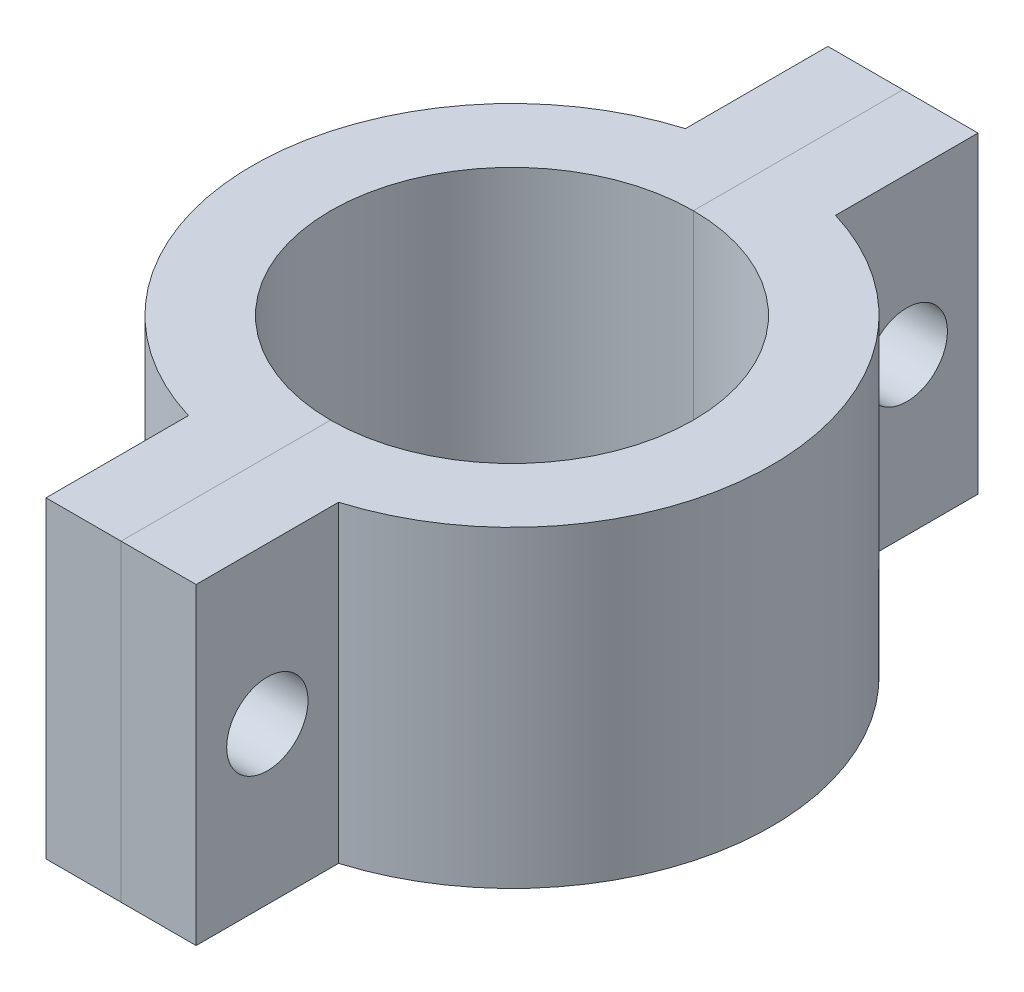
ISO-10303-21;
HEADER;
FILE_DESCRIPTION(('STEP AP214'),'2;1');
FILE_NAME('part.step','',(''),(''),'','','');
FILE_SCHEMA(('AUTOMOTIVE_DESIGN { 1 0 10303 214 1 1 1 1 }'));
ENDSEC;
DATA;
#1=APPLICATION_CONTEXT('core data for automotive mechanical design processes');
#2=APPLICATION_PROTOCOL_DEFINITION('international standard','automotive_design',2000,#1);
#3=PRODUCT_CONTEXT('',#1,'mechanical');
#4=PRODUCT('Part','Part','',(#3));
#5=PRODUCT_RELATED_PRODUCT_CATEGORY('part','',(#4));
#6=PRODUCT_DEFINITION_FORMATION('','',#4);
#7=PRODUCT_DEFINITION_CONTEXT('part definition',#1,'design');
#8=PRODUCT_DEFINITION('design','',#6,#7);
#9=PRODUCT_DEFINITION_SHAPE('','',#8);
#10=(LENGTH_UNIT() NAMED_UNIT(*) SI_UNIT(.MILLI.,.METRE.));
#11=(NAMED_UNIT(*) PLANE_ANGLE_UNIT() SI_UNIT($,.RADIAN.));
#12=(NAMED_UNIT(*) SI_UNIT($,.STERADIAN.) SOLID_ANGLE_UNIT());
#13=UNCERTAINTY_MEASURE_WITH_UNIT(LENGTH_MEASURE(1.E-05),#10,'distance_accuracy_value','');
#14=(GEOMETRIC_REPRESENTATION_CONTEXT(3) GLOBAL_UNCERTAINTY_ASSIGNED_CONTEXT((#13)) GLOBAL_UNIT_ASSIGNED_CONTEXT((#10,
#11,#12)) REPRESENTATION_CONTEXT('',''));
#15=CARTESIAN_POINT('',(0.,0.,0.));
#16=DIRECTION('',(0.,0.,1.));
#17=DIRECTION('',(1.,0.,0.));
#18=AXIS2_PLACEMENT_3D('',#15,#16,#17);
#19=CARTESIAN_POINT('',(0.,0.,0.));
#20=DIRECTION('',(-1.,0.,0.));
#21=DIRECTION('',(0.,0.,1.));
#22=AXIS2_PLACEMENT_3D('',#19,#20,#21);
#23=PLANE('',#22);
#24=CARTESIAN_POINT('',(0.,12.7,-25.9657074578545));
#25=DIRECTION('',(-1.,0.,0.));
#26=DIRECTION('',(0.,0.,1.));
#27=AXIS2_PLACEMENT_3D('',#24,#25,#26);
#28=CIRCLE('',#27,3.302);
#29=CARTESIAN_POINT('',(0.,12.7,-22.6637074578545));
#30=VERTEX_POINT('',#29);
#31=EDGE_CURVE('E191',#30,#30,#28,.F.);
#32=ORIENTED_EDGE('',*,*,#31,.T.);
#33=EDGE_LOOP('',(#32));
#34=FACE_BOUND('',#33,.T.);
#35=DIRECTION('',(0.,0.,1.));
#36=VECTOR('',#35,1.);
#37=CARTESIAN_POINT('',(0.,25.4,0.));
#38=LINE('',#37,#36);
#39=CARTESIAN_POINT('',(0.,25.4,-31.75));
#40=VERTEX_POINT('',#39);
#41=CARTESIAN_POINT('',(0.,25.4,-14.732));
#42=VERTEX_POINT('',#41);
#43=EDGE_CURVE('E151',#40,#42,#38,.T.);
#44=ORIENTED_EDGE('',*,*,#43,.F.);
#45=DIRECTION('',(0.,1.,0.));
#46=VECTOR('',#45,1.);
#47=CARTESIAN_POINT('',(0.,25.4,-31.75));
#48=LINE('',#47,#46);
#49=CARTESIAN_POINT('',(0.,0.,-31.75));
#50=VERTEX_POINT('',#49);
#51=EDGE_CURVE('E187',#50,#40,#48,.T.);
#52=ORIENTED_EDGE('',*,*,#51,.F.);
#53=DIRECTION('',(0.,0.,1.));
#54=VECTOR('',#53,1.);
#55=CARTESIAN_POINT('',(0.,0.,0.));
#56=LINE('',#55,#54);
#57=CARTESIAN_POINT('',(0.,0.,-14.732));
#58=VERTEX_POINT('',#57);
#59=EDGE_CURVE('E157',#50,#58,#56,.T.);
#60=ORIENTED_EDGE('',*,*,#59,.T.);
#61=DIRECTION('',(0.,-1.,0.));
#62=VECTOR('',#61,1.);
#63=CARTESIAN_POINT('',(0.,25.4,-14.732));
#64=LINE('',#63,#62);
#65=EDGE_CURVE('E139',#42,#58,#64,.T.);
#66=ORIENTED_EDGE('',*,*,#65,.F.);
#67=EDGE_LOOP('',(#44,#52,#60,#66));
#68=FACE_BOUND('',#67,.T.);
#69=ADVANCED_FACE('F54',(#34,#68),#23,.T.);
#70=CARTESIAN_POINT('',(0.,12.7,25.9657074578545));
#71=DIRECTION('',(-1.,0.,0.));
#72=DIRECTION('',(0.,0.,1.));
#73=AXIS2_PLACEMENT_3D('',#70,#71,#72);
#74=CIRCLE('',#73,3.302);
#75=CARTESIAN_POINT('',(0.,12.7,29.2677074578545));
#76=VERTEX_POINT('',#75);
#77=EDGE_CURVE('E189',#76,#76,#74,.F.);
#78=ORIENTED_EDGE('',*,*,#77,.T.);
#79=EDGE_LOOP('',(#78));
#80=FACE_BOUND('',#79,.T.);
#81=CARTESIAN_POINT('',(0.,25.4,14.732));
#82=VERTEX_POINT('',#81);
#83=CARTESIAN_POINT('',(0.,25.4,31.75));
#84=VERTEX_POINT('',#83);
#85=EDGE_CURVE('E150',#82,#84,#38,.T.);
#86=ORIENTED_EDGE('',*,*,#85,.F.);
#87=DIRECTION('',(0.,-1.,0.));
#88=VECTOR('',#87,1.);
#89=CARTESIAN_POINT('',(0.,25.4,14.732));
#90=LINE('',#89,#88);
#91=CARTESIAN_POINT('',(0.,0.,14.732));
#92=VERTEX_POINT('',#91);
#93=EDGE_CURVE('E136',#92,#82,#90,.F.);
#94=ORIENTED_EDGE('',*,*,#93,.F.);
#95=CARTESIAN_POINT('',(0.,0.,31.75));
#96=VERTEX_POINT('',#95);
#97=EDGE_CURVE('E149',#92,#96,#56,.T.);
#98=ORIENTED_EDGE('',*,*,#97,.T.);
#99=DIRECTION('',(0.,1.,0.));
#100=VECTOR('',#99,1.);
#101=CARTESIAN_POINT('',(0.,25.4,31.75));
#102=LINE('',#101,#100);
#103=EDGE_CURVE('E159',#96,#84,#102,.T.);
#104=ORIENTED_EDGE('',*,*,#103,.T.);
#105=EDGE_LOOP('',(#86,#94,#98,#104));
#106=FACE_BOUND('',#105,.T.);
#107=ADVANCED_FACE('F147',(#80,#106),#23,.T.);
#108=CARTESIAN_POINT('',(21.083,12.7,25.9657074578545));
#109=DIRECTION('',(-1.,0.,0.));
#110=DIRECTION('',(0.,0.,1.));
#111=AXIS2_PLACEMENT_3D('',#108,#109,#110);
#112=CYLINDRICAL_SURFACE('',#111,3.302);
#113=CARTESIAN_POINT('',(6.096,12.7,25.9657074578545));
#114=DIRECTION('',(1.,0.,0.));
#115=DIRECTION('',(0.,0.,-1.));
#116=AXIS2_PLACEMENT_3D('',#113,#114,#115);
#117=CIRCLE('',#116,3.302);
#118=CARTESIAN_POINT('',(6.096,12.7,22.6637074578545));
#119=VERTEX_POINT('',#118);
#120=EDGE_CURVE('E13',#119,#119,#117,.F.);
#121=ORIENTED_EDGE('',*,*,#120,.F.);
#122=EDGE_LOOP('',(#121));
#123=FACE_BOUND('',#122,.T.);
#124=ORIENTED_EDGE('',*,*,#77,.F.);
#125=EDGE_LOOP('',(#124));
#126=FACE_BOUND('',#125,.T.);
#127=ADVANCED_FACE('F56',(#123,#126),#112,.F.);
#128=CARTESIAN_POINT('',(21.083,12.7,-25.9657074578545));
#129=DIRECTION('',(-1.,0.,0.));
#130=DIRECTION('',(0.,0.,1.));
#131=AXIS2_PLACEMENT_3D('',#128,#129,#130);
#132=CYLINDRICAL_SURFACE('',#131,3.302);
#133=CARTESIAN_POINT('',(6.096,12.7,-25.9657074578545));
#134=DIRECTION('',(1.,0.,0.));
#135=DIRECTION('',(0.,0.,-1.));
#136=AXIS2_PLACEMENT_3D('',#133,#134,#135);
#137=CIRCLE('',#136,3.302);
#138=CARTESIAN_POINT('',(6.096,12.7,-29.2677074578545));
#139=VERTEX_POINT('',#138);
#140=EDGE_CURVE('E64',#139,#139,#137,.F.);
#141=ORIENTED_EDGE('',*,*,#140,.F.);
#142=EDGE_LOOP('',(#141));
#143=FACE_BOUND('',#142,.T.);
#144=ORIENTED_EDGE('',*,*,#31,.F.);
#145=EDGE_LOOP('',(#144));
#146=FACE_BOUND('',#145,.T.);
#147=ADVANCED_FACE('F215',(#143,#146),#132,.F.);
#148=CARTESIAN_POINT('',(0.,25.4,-31.75));
#149=DIRECTION('',(0.,0.,-1.));
#150=DIRECTION('',(-1.,0.,0.));
#151=AXIS2_PLACEMENT_3D('',#148,#149,#150);
#152=PLANE('',#151);
#153=DIRECTION('',(1.,0.,0.));
#154=VECTOR('',#153,1.);
#155=CARTESIAN_POINT('',(0.,0.,-31.75));
#156=LINE('',#155,#154);
#157=CARTESIAN_POINT('',(6.096,0.,-31.75));
#158=VERTEX_POINT('',#157);
#159=EDGE_CURVE('E171',#50,#158,#156,.T.);
#160=ORIENTED_EDGE('',*,*,#159,.F.);
#161=ORIENTED_EDGE('',*,*,#51,.T.);
#162=DIRECTION('',(1.,0.,0.));
#163=VECTOR('',#162,1.);
#164=CARTESIAN_POINT('',(0.,25.4,-31.75));
#165=LINE('',#164,#163);
#166=CARTESIAN_POINT('',(6.096,25.4,-31.75));
#167=VERTEX_POINT('',#166);
#168=EDGE_CURVE('E92',#40,#167,#165,.T.);
#169=ORIENTED_EDGE('',*,*,#168,.T.);
#170=DIRECTION('',(0.,-1.,0.));
#171=VECTOR('',#170,1.);
#172=CARTESIAN_POINT('',(6.096,25.4,-31.75));
#173=LINE('',#172,#171);
#174=EDGE_CURVE('E202',#167,#158,#173,.T.);
#175=ORIENTED_EDGE('',*,*,#174,.T.);
#176=EDGE_LOOP('',(#160,#161,#169,#175));
#177=FACE_BOUND('',#176,.T.);
#178=ADVANCED_FACE('F213',(#177),#152,.T.);
#179=CARTESIAN_POINT('',(0.,25.4,31.75));
#180=DIRECTION('',(0.,0.,-1.));
#181=DIRECTION('',(-1.,0.,0.));
#182=AXIS2_PLACEMENT_3D('',#179,#180,#181);
#183=PLANE('',#182);
#184=ORIENTED_EDGE('',*,*,#103,.F.);
#185=DIRECTION('',(1.,0.,0.));
#186=VECTOR('',#185,1.);
#187=CARTESIAN_POINT('',(0.,0.,31.75));
#188=LINE('',#187,#186);
#189=CARTESIAN_POINT('',(6.096,0.,31.75));
#190=VERTEX_POINT('',#189);
#191=EDGE_CURVE('E155',#96,#190,#188,.T.);
#192=ORIENTED_EDGE('',*,*,#191,.T.);
#193=DIRECTION('',(0.,-1.,0.));
#194=VECTOR('',#193,1.);
#195=CARTESIAN_POINT('',(6.096,25.4,31.75));
#196=LINE('',#195,#194);
#197=CARTESIAN_POINT('',(6.096,25.4,31.75));
#198=VERTEX_POINT('',#197);
#199=EDGE_CURVE('E200',#198,#190,#196,.T.);
#200=ORIENTED_EDGE('',*,*,#199,.F.);
#201=DIRECTION('',(1.,0.,0.));
#202=VECTOR('',#201,1.);
#203=CARTESIAN_POINT('',(0.,25.4,31.75));
#204=LINE('',#203,#202);
#205=EDGE_CURVE('E163',#84,#198,#204,.T.);
#206=ORIENTED_EDGE('',*,*,#205,.F.);
#207=EDGE_LOOP('',(#184,#192,#200,#206));
#208=FACE_BOUND('',#207,.T.);
#209=ADVANCED_FACE('F198',(#208),#183,.F.);
#210=CARTESIAN_POINT('',(0.,25.4,0.));
#211=DIRECTION('',(0.,-1.,0.));
#212=DIRECTION('',(0.,0.,-1.));
#213=AXIS2_PLACEMENT_3D('',#210,#211,#212);
#214=CYLINDRICAL_SURFACE('',#213,14.732);
#215=CARTESIAN_POINT('',(0.,25.4,0.));
#216=DIRECTION('',(0.,1.,0.));
#217=DIRECTION('',(0.,0.,1.));
#218=AXIS2_PLACEMENT_3D('',#215,#216,#217);
#219=CIRCLE('',#218,14.732);
#220=EDGE_CURVE('E168',#82,#42,#219,.T.);
#221=ORIENTED_EDGE('',*,*,#220,.T.);
#222=ORIENTED_EDGE('',*,*,#65,.T.);
#223=CARTESIAN_POINT('',(0.,0.,0.));
#224=DIRECTION('',(0.,1.,0.));
#225=DIRECTION('',(0.,0.,1.));
#226=AXIS2_PLACEMENT_3D('',#223,#224,#225);
#227=CIRCLE('',#226,14.732);
#228=EDGE_CURVE('E58',#92,#58,#227,.T.);
#229=ORIENTED_EDGE('',*,*,#228,.F.);
#230=ORIENTED_EDGE('',*,*,#93,.T.);
#231=EDGE_LOOP('',(#221,#222,#229,#230));
#232=FACE_BOUND('',#231,.T.);
#233=ADVANCED_FACE('F135',(#232),#214,.F.);
#234=CARTESIAN_POINT('',(0.,25.4,0.));
#235=DIRECTION('',(0.,1.,0.));
#236=DIRECTION('',(0.,0.,1.));
#237=AXIS2_PLACEMENT_3D('',#234,#235,#236);
#238=PLANE('',#237);
#239=ORIENTED_EDGE('',*,*,#168,.F.);
#240=ORIENTED_EDGE('',*,*,#43,.T.);
#241=ORIENTED_EDGE('',*,*,#220,.F.);
#242=ORIENTED_EDGE('',*,*,#85,.T.);
#243=ORIENTED_EDGE('',*,*,#205,.T.);
#244=DIRECTION('',(0.,0.,1.));
#245=VECTOR('',#244,1.);
#246=CARTESIAN_POINT('',(6.096,25.4,0.));
#247=LINE('',#246,#245);
#248=CARTESIAN_POINT('',(6.096,25.4,20.181414915709));
#249=VERTEX_POINT('',#248);
#250=EDGE_CURVE('E165',#249,#198,#247,.T.);
#251=ORIENTED_EDGE('',*,*,#250,.F.);
#252=CARTESIAN_POINT('',(0.,25.4,0.));
#253=DIRECTION('',(0.,1.,0.));
#254=DIRECTION('',(0.,0.,1.));
#255=AXIS2_PLACEMENT_3D('',#252,#253,#254);
#256=CIRCLE('',#255,21.082);
#257=CARTESIAN_POINT('',(6.096,25.4,-20.181414915709));
#258=VERTEX_POINT('',#257);
#259=EDGE_CURVE('E100',#249,#258,#256,.T.);
#260=ORIENTED_EDGE('',*,*,#259,.T.);
#261=DIRECTION('',(0.,0.,1.));
#262=VECTOR('',#261,1.);
#263=CARTESIAN_POINT('',(6.096,25.4,0.));
#264=LINE('',#263,#262);
#265=EDGE_CURVE('E167',#167,#258,#264,.T.);
#266=ORIENTED_EDGE('',*,*,#265,.F.);
#267=EDGE_LOOP('',(#239,#240,#241,#242,#243,#251,#260,#266));
#268=FACE_BOUND('',#267,.T.);
#269=ADVANCED_FACE('F201',(#268),#238,.T.);
#270=CARTESIAN_POINT('',(0.,0.,0.));
#271=DIRECTION('',(0.,1.,0.));
#272=DIRECTION('',(0.,0.,1.));
#273=AXIS2_PLACEMENT_3D('',#270,#271,#272);
#274=PLANE('',#273);
#275=ORIENTED_EDGE('',*,*,#59,.F.);
#276=ORIENTED_EDGE('',*,*,#159,.T.);
#277=DIRECTION('',(0.,0.,1.));
#278=VECTOR('',#277,1.);
#279=CARTESIAN_POINT('',(6.096,0.,0.));
#280=LINE('',#279,#278);
#281=CARTESIAN_POINT('',(6.096,0.,-20.181414915709));
#282=VERTEX_POINT('',#281);
#283=EDGE_CURVE('E172',#158,#282,#280,.T.);
#284=ORIENTED_EDGE('',*,*,#283,.T.);
#285=CARTESIAN_POINT('',(0.,0.,0.));
#286=DIRECTION('',(0.,1.,0.));
#287=DIRECTION('',(0.,0.,1.));
#288=AXIS2_PLACEMENT_3D('',#285,#286,#287);
#289=CIRCLE('',#288,21.082);
#290=CARTESIAN_POINT('',(6.096,0.,20.181414915709));
#291=VERTEX_POINT('',#290);
#292=EDGE_CURVE('E144',#291,#282,#289,.T.);
#293=ORIENTED_EDGE('',*,*,#292,.F.);
#294=DIRECTION('',(0.,0.,1.));
#295=VECTOR('',#294,1.);
#296=CARTESIAN_POINT('',(6.096,0.,0.));
#297=LINE('',#296,#295);
#298=EDGE_CURVE('E170',#291,#190,#297,.T.);
#299=ORIENTED_EDGE('',*,*,#298,.T.);
#300=ORIENTED_EDGE('',*,*,#191,.F.);
#301=ORIENTED_EDGE('',*,*,#97,.F.);
#302=ORIENTED_EDGE('',*,*,#228,.T.);
#303=EDGE_LOOP('',(#275,#276,#284,#293,#299,#300,#301,#302));
#304=FACE_BOUND('',#303,.T.);
#305=ADVANCED_FACE('F153',(#304),#274,.F.);
#306=CARTESIAN_POINT('',(0.,25.4,0.));
#307=DIRECTION('',(0.,-1.,0.));
#308=DIRECTION('',(0.,0.,-1.));
#309=AXIS2_PLACEMENT_3D('',#306,#307,#308);
#310=CYLINDRICAL_SURFACE('',#309,21.082);
#311=ORIENTED_EDGE('',*,*,#292,.T.);
#312=DIRECTION('',(0.,-1.,0.));
#313=VECTOR('',#312,1.);
#314=CARTESIAN_POINT('',(6.096,25.4,-20.181414915709));
#315=LINE('',#314,#313);
#316=EDGE_CURVE('E73',#258,#282,#315,.T.);
#317=ORIENTED_EDGE('',*,*,#316,.F.);
#318=ORIENTED_EDGE('',*,*,#259,.F.);
#319=DIRECTION('',(0.,-1.,0.));
#320=VECTOR('',#319,1.);
#321=CARTESIAN_POINT('',(6.096,25.4,20.181414915709));
#322=LINE('',#321,#320);
#323=EDGE_CURVE('E104',#249,#291,#322,.T.);
#324=ORIENTED_EDGE('',*,*,#323,.T.);
#325=EDGE_LOOP('',(#311,#317,#318,#324));
#326=FACE_BOUND('',#325,.T.);
#327=ADVANCED_FACE('F209',(#326),#310,.T.);
#328=CARTESIAN_POINT('',(6.096,25.4,0.));
#329=DIRECTION('',(1.,0.,0.));
#330=DIRECTION('',(0.,0.,-1.));
#331=AXIS2_PLACEMENT_3D('',#328,#329,#330);
#332=PLANE('',#331);
#333=ORIENTED_EDGE('',*,*,#140,.T.);
#334=EDGE_LOOP('',(#333));
#335=FACE_BOUND('',#334,.T.);
#336=ORIENTED_EDGE('',*,*,#283,.F.);
#337=ORIENTED_EDGE('',*,*,#174,.F.);
#338=ORIENTED_EDGE('',*,*,#265,.T.);
#339=ORIENTED_EDGE('',*,*,#316,.T.);
#340=EDGE_LOOP('',(#336,#337,#338,#339));
#341=FACE_BOUND('',#340,.T.);
#342=ADVANCED_FACE('F210',(#335,#341),#332,.T.);
#343=CARTESIAN_POINT('',(6.096,25.4,0.));
#344=DIRECTION('',(1.,0.,0.));
#345=DIRECTION('',(0.,0.,-1.));
#346=AXIS2_PLACEMENT_3D('',#343,#344,#345);
#347=PLANE('',#346);
#348=ORIENTED_EDGE('',*,*,#120,.T.);
#349=EDGE_LOOP('',(#348));
#350=FACE_BOUND('',#349,.T.);
#351=ORIENTED_EDGE('',*,*,#298,.F.);
#352=ORIENTED_EDGE('',*,*,#323,.F.);
#353=ORIENTED_EDGE('',*,*,#250,.T.);
#354=ORIENTED_EDGE('',*,*,#199,.T.);
#355=EDGE_LOOP('',(#351,#352,#353,#354));
#356=FACE_BOUND('',#355,.T.);
#357=ADVANCED_FACE('F208',(#350,#356),#347,.T.);
#358=CLOSED_SHELL('',(#69,#107,#127,#147,#178,#209,#233,#269,#305,#327,#342,#357));
#359=MANIFOLD_SOLID_BREP('B2',#358);
#360=CARTESIAN_POINT('',(0.,0.,0.));
#361=DIRECTION('',(-1.,0.,0.));
#362=DIRECTION('',(0.,0.,1.));
#363=AXIS2_PLACEMENT_3D('',#360,#361,#362);
#364=PLANE('',#363);
#365=DIRECTION('',(0.,0.,1.));
#366=VECTOR('',#365,1.);
#367=CARTESIAN_POINT('',(0.,25.4,0.));
#368=LINE('',#367,#366);
#369=CARTESIAN_POINT('',(0.,25.4,-31.75));
#370=VERTEX_POINT('',#369);
#371=CARTESIAN_POINT('',(0.,25.4,-14.732));
#372=VERTEX_POINT('',#371);
#373=EDGE_CURVE('E356',#370,#372,#368,.T.);
#374=ORIENTED_EDGE('',*,*,#373,.T.);
#375=DIRECTION('',(0.,-1.,0.));
#376=VECTOR('',#375,1.);
#377=CARTESIAN_POINT('',(0.,25.4,-14.732));
#378=LINE('',#377,#376);
#379=CARTESIAN_POINT('',(0.,0.,-14.732));
#380=VERTEX_POINT('',#379);
#381=EDGE_CURVE('E371',#372,#380,#378,.T.);
#382=ORIENTED_EDGE('',*,*,#381,.T.);
#383=DIRECTION('',(0.,0.,1.));
#384=VECTOR('',#383,1.);
#385=CARTESIAN_POINT('',(0.,0.,0.));
#386=LINE('',#385,#384);
#387=CARTESIAN_POINT('',(0.,0.,-31.75));
#388=VERTEX_POINT('',#387);
#389=EDGE_CURVE('E478',#388,#380,#386,.T.);
#390=ORIENTED_EDGE('',*,*,#389,.F.);
#391=DIRECTION('',(0.,1.,0.));
#392=VECTOR('',#391,1.);
#393=CARTESIAN_POINT('',(0.,25.4,-31.75));
#394=LINE('',#393,#392);
#395=EDGE_CURVE('E484',#388,#370,#394,.T.);
#396=ORIENTED_EDGE('',*,*,#395,.T.);
#397=EDGE_LOOP('',(#374,#382,#390,#396));
#398=FACE_BOUND('',#397,.T.);
#399=CARTESIAN_POINT('',(0.,12.7,-25.9657074578545));
#400=DIRECTION('',(-1.,0.,0.));
#401=DIRECTION('',(0.,0.,1.));
#402=AXIS2_PLACEMENT_3D('',#399,#400,#401);
#403=CIRCLE('',#402,3.302);
#404=CARTESIAN_POINT('',(0.,12.7,-22.6637074578545));
#405=VERTEX_POINT('',#404);
#406=EDGE_CURVE('E481',#405,#405,#403,.F.);
#407=ORIENTED_EDGE('',*,*,#406,.F.);
#408=EDGE_LOOP('',(#407));
#409=FACE_BOUND('',#408,.T.);
#410=ADVANCED_FACE('F347',(#398,#409),#364,.F.);
#411=CARTESIAN_POINT('',(0.,25.4,14.732));
#412=VERTEX_POINT('',#411);
#413=CARTESIAN_POINT('',(0.,25.4,31.75));
#414=VERTEX_POINT('',#413);
#415=EDGE_CURVE('E52',#412,#414,#368,.T.);
#416=ORIENTED_EDGE('',*,*,#415,.T.);
#417=DIRECTION('',(0.,1.,0.));
#418=VECTOR('',#417,1.);
#419=CARTESIAN_POINT('',(0.,25.4,31.75));
#420=LINE('',#419,#418);
#421=CARTESIAN_POINT('',(0.,0.,31.75));
#422=VERTEX_POINT('',#421);
#423=EDGE_CURVE('E480',#422,#414,#420,.T.);
#424=ORIENTED_EDGE('',*,*,#423,.F.);
#425=CARTESIAN_POINT('',(0.,0.,14.732));
#426=VERTEX_POINT('',#425);
#427=EDGE_CURVE('E425',#426,#422,#386,.T.);
#428=ORIENTED_EDGE('',*,*,#427,.F.);
#429=DIRECTION('',(0.,-1.,0.));
#430=VECTOR('',#429,1.);
#431=CARTESIAN_POINT('',(0.,25.4,14.732));
#432=LINE('',#431,#430);
#433=EDGE_CURVE('E363',#426,#412,#432,.F.);
#434=ORIENTED_EDGE('',*,*,#433,.T.);
#435=EDGE_LOOP('',(#416,#424,#428,#434));
#436=FACE_BOUND('',#435,.T.);
#437=CARTESIAN_POINT('',(0.,12.7,25.9657074578545));
#438=DIRECTION('',(-1.,0.,0.));
#439=DIRECTION('',(0.,0.,1.));
#440=AXIS2_PLACEMENT_3D('',#437,#438,#439);
#441=CIRCLE('',#440,3.302);
#442=CARTESIAN_POINT('',(0.,12.7,29.2677074578545));
#443=VERTEX_POINT('',#442);
#444=EDGE_CURVE('E351',#443,#443,#441,.F.);
#445=ORIENTED_EDGE('',*,*,#444,.F.);
#446=EDGE_LOOP('',(#445));
#447=FACE_BOUND('',#446,.T.);
#448=ADVANCED_FACE('F349',(#436,#447),#364,.F.);
#449=CARTESIAN_POINT('',(-1.016,12.7,-25.9657074578545));
#450=DIRECTION('',(-1.,0.,0.));
#451=DIRECTION('',(0.,0.,1.));
#452=AXIS2_PLACEMENT_3D('',#449,#450,#451);
#453=CYLINDRICAL_SURFACE('',#452,4.7625);
#454=CARTESIAN_POINT('',(-1.016,12.7,-25.9657074578545));
#455=DIRECTION('',(-1.,0.,0.));
#456=DIRECTION('',(0.,0.,1.));
#457=AXIS2_PLACEMENT_3D('',#454,#455,#456);
#458=CIRCLE('',#457,4.7625);
#459=CARTESIAN_POINT('',(-1.016,12.7,-21.2032074578545));
#460=VERTEX_POINT('',#459);
#461=EDGE_CURVE('E474',#460,#460,#458,.T.);
#462=ORIENTED_EDGE('',*,*,#461,.F.);
#463=EDGE_LOOP('',(#462));
#464=FACE_BOUND('',#463,.T.);
#465=CARTESIAN_POINT('',(-6.096,12.7,-25.9657074578545));
#466=DIRECTION('',(-1.,0.,0.));
#467=DIRECTION('',(0.,0.,1.));
#468=AXIS2_PLACEMENT_3D('',#465,#466,#467);
#469=CIRCLE('',#468,4.7625);
#470=CARTESIAN_POINT('',(-6.096,12.7,-21.2032074578545));
#471=VERTEX_POINT('',#470);
#472=EDGE_CURVE('E652',#471,#471,#469,.T.);
#473=ORIENTED_EDGE('',*,*,#472,.T.);
#474=EDGE_LOOP('',(#473));
#475=FACE_BOUND('',#474,.T.);
#476=ADVANCED_FACE('F495',(#464,#475),#453,.F.);
#477=CARTESIAN_POINT('',(-1.016,12.7,25.9657074578545));
#478=DIRECTION('',(-1.,0.,0.));
#479=DIRECTION('',(0.,0.,1.));
#480=AXIS2_PLACEMENT_3D('',#477,#478,#479);
#481=CYLINDRICAL_SURFACE('',#480,4.7625);
#482=CARTESIAN_POINT('',(-1.016,12.7,25.9657074578545));
#483=DIRECTION('',(-1.,0.,0.));
#484=DIRECTION('',(0.,0.,1.));
#485=AXIS2_PLACEMENT_3D('',#482,#483,#484);
#486=CIRCLE('',#485,4.7625);
#487=CARTESIAN_POINT('',(-1.01599999999999,12.7,30.7282074578545));
#488=VERTEX_POINT('',#487);
#489=EDGE_CURVE('E648',#488,#488,#486,.T.);
#490=ORIENTED_EDGE('',*,*,#489,.F.);
#491=EDGE_LOOP('',(#490));
#492=FACE_BOUND('',#491,.T.);
#493=CARTESIAN_POINT('',(-6.096,12.7,25.9657074578545));
#494=DIRECTION('',(-1.,0.,0.));
#495=DIRECTION('',(0.,0.,1.));
#496=AXIS2_PLACEMENT_3D('',#493,#494,#495);
#497=CIRCLE('',#496,4.7625);
#498=CARTESIAN_POINT('',(-6.09599999999999,12.7,30.7282074578545));
#499=VERTEX_POINT('',#498);
#500=EDGE_CURVE('E651',#499,#499,#497,.T.);
#501=ORIENTED_EDGE('',*,*,#500,.T.);
#502=EDGE_LOOP('',(#501));
#503=FACE_BOUND('',#502,.T.);
#504=ADVANCED_FACE('F501',(#492,#503),#481,.F.);
#505=CARTESIAN_POINT('',(-6.096,25.4,0.));
#506=DIRECTION('',(1.,0.,0.));
#507=DIRECTION('',(0.,0.,-1.));
#508=AXIS2_PLACEMENT_3D('',#505,#506,#507);
#509=PLANE('',#508);
#510=ORIENTED_EDGE('',*,*,#472,.F.);
#511=EDGE_LOOP('',(#510));
#512=FACE_BOUND('',#511,.T.);
#513=DIRECTION('',(0.,0.,1.));
#514=VECTOR('',#513,1.);
#515=CARTESIAN_POINT('',(-6.096,0.,0.));
#516=LINE('',#515,#514);
#517=CARTESIAN_POINT('',(-6.096,0.,-31.75));
#518=VERTEX_POINT('',#517);
#519=CARTESIAN_POINT('',(-6.096,0.,-20.181414915709));
#520=VERTEX_POINT('',#519);
#521=EDGE_CURVE('E457',#518,#520,#516,.T.);
#522=ORIENTED_EDGE('',*,*,#521,.T.);
#523=DIRECTION('',(0.,-1.,0.));
#524=VECTOR('',#523,1.);
#525=CARTESIAN_POINT('',(-6.096,25.4,-20.181414915709));
#526=LINE('',#525,#524);
#527=CARTESIAN_POINT('',(-6.096,25.4,-20.181414915709));
#528=VERTEX_POINT('',#527);
#529=EDGE_CURVE('E426',#528,#520,#526,.T.);
#530=ORIENTED_EDGE('',*,*,#529,.F.);
#531=DIRECTION('',(0.,0.,1.));
#532=VECTOR('',#531,1.);
#533=CARTESIAN_POINT('',(-6.096,25.4,0.));
#534=LINE('',#533,#532);
#535=CARTESIAN_POINT('',(-6.096,25.4,-31.75));
#536=VERTEX_POINT('',#535);
#537=EDGE_CURVE('E429',#536,#528,#534,.T.);
#538=ORIENTED_EDGE('',*,*,#537,.F.);
#539=DIRECTION('',(0.,-1.,0.));
#540=VECTOR('',#539,1.);
#541=CARTESIAN_POINT('',(-6.096,25.4,-31.75));
#542=LINE('',#541,#540);
#543=EDGE_CURVE('E416',#536,#518,#542,.T.);
#544=ORIENTED_EDGE('',*,*,#543,.T.);
#545=EDGE_LOOP('',(#522,#530,#538,#544));
#546=FACE_BOUND('',#545,.T.);
#547=ADVANCED_FACE('F430',(#512,#546),#509,.F.);
#548=CARTESIAN_POINT('',(0.,25.4,0.));
#549=DIRECTION('',(0.,-1.,0.));
#550=DIRECTION('',(0.,0.,-1.));
#551=AXIS2_PLACEMENT_3D('',#548,#549,#550);
#552=CYLINDRICAL_SURFACE('',#551,21.082);
#553=CARTESIAN_POINT('',(0.,0.,0.));
#554=DIRECTION('',(0.,1.,0.));
#555=DIRECTION('',(0.,0.,1.));
#556=AXIS2_PLACEMENT_3D('',#553,#554,#555);
#557=CIRCLE('',#556,21.082);
#558=CARTESIAN_POINT('',(-6.096,0.,20.181414915709));
#559=VERTEX_POINT('',#558);
#560=EDGE_CURVE('E459',#520,#559,#557,.T.);
#561=ORIENTED_EDGE('',*,*,#560,.T.);
#562=DIRECTION('',(0.,-1.,0.));
#563=VECTOR('',#562,1.);
#564=CARTESIAN_POINT('',(-6.096,25.4,20.181414915709));
#565=LINE('',#564,#563);
#566=CARTESIAN_POINT('',(-6.096,25.4,20.181414915709));
#567=VERTEX_POINT('',#566);
#568=EDGE_CURVE('E467',#567,#559,#565,.T.);
#569=ORIENTED_EDGE('',*,*,#568,.F.);
#570=CARTESIAN_POINT('',(0.,25.4,0.));
#571=DIRECTION('',(0.,1.,0.));
#572=DIRECTION('',(0.,0.,1.));
#573=AXIS2_PLACEMENT_3D('',#570,#571,#572);
#574=CIRCLE('',#573,21.082);
#575=EDGE_CURVE('E434',#528,#567,#574,.T.);
#576=ORIENTED_EDGE('',*,*,#575,.F.);
#577=ORIENTED_EDGE('',*,*,#529,.T.);
#578=EDGE_LOOP('',(#561,#569,#576,#577));
#579=FACE_BOUND('',#578,.T.);
#580=ADVANCED_FACE('F531',(#579),#552,.T.);
#581=CARTESIAN_POINT('',(-6.096,25.4,0.));
#582=DIRECTION('',(1.,0.,0.));
#583=DIRECTION('',(0.,0.,-1.));
#584=AXIS2_PLACEMENT_3D('',#581,#582,#583);
#585=PLANE('',#584);
#586=ORIENTED_EDGE('',*,*,#500,.F.);
#587=EDGE_LOOP('',(#586));
#588=FACE_BOUND('',#587,.T.);
#589=DIRECTION('',(0.,0.,1.));
#590=VECTOR('',#589,1.);
#591=CARTESIAN_POINT('',(-6.096,0.,0.));
#592=LINE('',#591,#590);
#593=CARTESIAN_POINT('',(-6.096,0.,31.75));
#594=VERTEX_POINT('',#593);
#595=EDGE_CURVE('E461',#559,#594,#592,.T.);
#596=ORIENTED_EDGE('',*,*,#595,.T.);
#597=DIRECTION('',(0.,-1.,0.));
#598=VECTOR('',#597,1.);
#599=CARTESIAN_POINT('',(-6.096,25.4,31.75));
#600=LINE('',#599,#598);
#601=CARTESIAN_POINT('',(-6.096,25.4,31.75));
#602=VERTEX_POINT('',#601);
#603=EDGE_CURVE('E451',#602,#594,#600,.T.);
#604=ORIENTED_EDGE('',*,*,#603,.F.);
#605=DIRECTION('',(0.,0.,1.));
#606=VECTOR('',#605,1.);
#607=CARTESIAN_POINT('',(-6.096,25.4,0.));
#608=LINE('',#607,#606);
#609=EDGE_CURVE('E446',#567,#602,#608,.T.);
#610=ORIENTED_EDGE('',*,*,#609,.F.);
#611=ORIENTED_EDGE('',*,*,#568,.T.);
#612=EDGE_LOOP('',(#596,#604,#610,#611));
#613=FACE_BOUND('',#612,.T.);
#614=ADVANCED_FACE('F527',(#588,#613),#585,.F.);
#615=CARTESIAN_POINT('',(0.,25.4,31.75));
#616=DIRECTION('',(0.,0.,-1.));
#617=DIRECTION('',(-1.,0.,0.));
#618=AXIS2_PLACEMENT_3D('',#615,#616,#617);
#619=PLANE('',#618);
#620=DIRECTION('',(1.,0.,0.));
#621=VECTOR('',#620,1.);
#622=CARTESIAN_POINT('',(0.,0.,31.75));
#623=LINE('',#622,#621);
#624=EDGE_CURVE('E441',#594,#422,#623,.T.);
#625=ORIENTED_EDGE('',*,*,#624,.T.);
#626=ORIENTED_EDGE('',*,*,#423,.T.);
#627=DIRECTION('',(1.,0.,0.));
#628=VECTOR('',#627,1.);
#629=CARTESIAN_POINT('',(0.,25.4,31.75));
#630=LINE('',#629,#628);
#631=EDGE_CURVE('E448',#602,#414,#630,.T.);
#632=ORIENTED_EDGE('',*,*,#631,.F.);
#633=ORIENTED_EDGE('',*,*,#603,.T.);
#634=EDGE_LOOP('',(#625,#626,#632,#633));
#635=FACE_BOUND('',#634,.T.);
#636=ADVANCED_FACE('F524',(#635),#619,.F.);
#637=CARTESIAN_POINT('',(0.,25.4,0.));
#638=DIRECTION('',(0.,-1.,0.));
#639=DIRECTION('',(0.,0.,-1.));
#640=AXIS2_PLACEMENT_3D('',#637,#638,#639);
#641=CYLINDRICAL_SURFACE('',#640,14.732);
#642=ORIENTED_EDGE('',*,*,#381,.F.);
#643=CARTESIAN_POINT('',(0.,25.4,0.));
#644=DIRECTION('',(0.,1.,0.));
#645=DIRECTION('',(0.,0.,1.));
#646=AXIS2_PLACEMENT_3D('',#643,#644,#645);
#647=CIRCLE('',#646,14.732);
#648=EDGE_CURVE('E439',#372,#412,#647,.T.);
#649=ORIENTED_EDGE('',*,*,#648,.T.);
#650=ORIENTED_EDGE('',*,*,#433,.F.);
#651=CARTESIAN_POINT('',(0.,0.,0.));
#652=DIRECTION('',(0.,1.,0.));
#653=DIRECTION('',(0.,0.,1.));
#654=AXIS2_PLACEMENT_3D('',#651,#652,#653);
#655=CIRCLE('',#654,14.732);
#656=EDGE_CURVE('E452',#380,#426,#655,.T.);
#657=ORIENTED_EDGE('',*,*,#656,.F.);
#658=EDGE_LOOP('',(#642,#649,#650,#657));
#659=FACE_BOUND('',#658,.T.);
#660=ADVANCED_FACE('F526',(#659),#641,.F.);
#661=CARTESIAN_POINT('',(0.,25.4,-31.75));
#662=DIRECTION('',(0.,0.,-1.));
#663=DIRECTION('',(-1.,0.,0.));
#664=AXIS2_PLACEMENT_3D('',#661,#662,#663);
#665=PLANE('',#664);
#666=ORIENTED_EDGE('',*,*,#395,.F.);
#667=DIRECTION('',(1.,0.,0.));
#668=VECTOR('',#667,1.);
#669=CARTESIAN_POINT('',(0.,0.,-31.75));
#670=LINE('',#669,#668);
#671=EDGE_CURVE('E422',#518,#388,#670,.T.);
#672=ORIENTED_EDGE('',*,*,#671,.F.);
#673=ORIENTED_EDGE('',*,*,#543,.F.);
#674=DIRECTION('',(1.,0.,0.));
#675=VECTOR('',#674,1.);
#676=CARTESIAN_POINT('',(0.,25.4,-31.75));
#677=LINE('',#676,#675);
#678=EDGE_CURVE('E420',#536,#370,#677,.T.);
#679=ORIENTED_EDGE('',*,*,#678,.T.);
#680=EDGE_LOOP('',(#666,#672,#673,#679));
#681=FACE_BOUND('',#680,.T.);
#682=ADVANCED_FACE('F418',(#681),#665,.T.);
#683=CARTESIAN_POINT('',(0.,0.,0.));
#684=DIRECTION('',(0.,1.,0.));
#685=DIRECTION('',(0.,0.,1.));
#686=AXIS2_PLACEMENT_3D('',#683,#684,#685);
#687=PLANE('',#686);
#688=ORIENTED_EDGE('',*,*,#671,.T.);
#689=ORIENTED_EDGE('',*,*,#389,.T.);
#690=ORIENTED_EDGE('',*,*,#656,.T.);
#691=ORIENTED_EDGE('',*,*,#427,.T.);
#692=ORIENTED_EDGE('',*,*,#624,.F.);
#693=ORIENTED_EDGE('',*,*,#595,.F.);
#694=ORIENTED_EDGE('',*,*,#560,.F.);
#695=ORIENTED_EDGE('',*,*,#521,.F.);
#696=EDGE_LOOP('',(#688,#689,#690,#691,#692,#693,#694,#695));
#697=FACE_BOUND('',#696,.T.);
#698=ADVANCED_FACE('F520',(#697),#687,.F.);
#699=CARTESIAN_POINT('',(0.,25.4,0.));
#700=DIRECTION('',(0.,1.,0.));
#701=DIRECTION('',(0.,0.,1.));
#702=AXIS2_PLACEMENT_3D('',#699,#700,#701);
#703=PLANE('',#702);
#704=ORIENTED_EDGE('',*,*,#373,.F.);
#705=ORIENTED_EDGE('',*,*,#678,.F.);
#706=ORIENTED_EDGE('',*,*,#537,.T.);
#707=ORIENTED_EDGE('',*,*,#575,.T.);
#708=ORIENTED_EDGE('',*,*,#609,.T.);
#709=ORIENTED_EDGE('',*,*,#631,.T.);
#710=ORIENTED_EDGE('',*,*,#415,.F.);
#711=ORIENTED_EDGE('',*,*,#648,.F.);
#712=EDGE_LOOP('',(#704,#705,#706,#707,#708,#709,#710,#711));
#713=FACE_BOUND('',#712,.T.);
#714=ADVANCED_FACE('F437',(#713),#703,.T.);
#715=CARTESIAN_POINT('',(-1.016,12.7,-25.9657074578545));
#716=DIRECTION('',(-1.,0.,0.));
#717=DIRECTION('',(0.,0.,1.));
#718=AXIS2_PLACEMENT_3D('',#715,#716,#717);
#719=PLANE('',#718);
#720=ORIENTED_EDGE('',*,*,#461,.T.);
#721=EDGE_LOOP('',(#720));
#722=FACE_BOUND('',#721,.T.);
#723=CARTESIAN_POINT('',(-1.016,12.7,-25.9657074578545));
#724=DIRECTION('',(-1.,0.,0.));
#725=DIRECTION('',(0.,0.,1.));
#726=AXIS2_PLACEMENT_3D('',#723,#724,#725);
#727=CIRCLE('',#726,3.302);
#728=CARTESIAN_POINT('',(-1.016,12.7,-22.6637074578545));
#729=VERTEX_POINT('',#728);
#730=EDGE_CURVE('E471',#729,#729,#727,.F.);
#731=ORIENTED_EDGE('',*,*,#730,.T.);
#732=EDGE_LOOP('',(#731));
#733=FACE_BOUND('',#732,.T.);
#734=ADVANCED_FACE('F519',(#722,#733),#719,.T.);
#735=CARTESIAN_POINT('',(21.083,12.7,-25.9657074578545));
#736=DIRECTION('',(-1.,0.,0.));
#737=DIRECTION('',(0.,0.,1.));
#738=AXIS2_PLACEMENT_3D('',#735,#736,#737);
#739=CYLINDRICAL_SURFACE('',#738,3.302);
#740=ORIENTED_EDGE('',*,*,#406,.T.);
#741=EDGE_LOOP('',(#740));
#742=FACE_BOUND('',#741,.T.);
#743=ORIENTED_EDGE('',*,*,#730,.F.);
#744=EDGE_LOOP('',(#743));
#745=FACE_BOUND('',#744,.T.);
#746=ADVANCED_FACE('F512',(#742,#745),#739,.F.);
#747=CARTESIAN_POINT('',(-1.016,12.7,25.9657074578545));
#748=DIRECTION('',(-1.,0.,0.));
#749=DIRECTION('',(0.,0.,1.));
#750=AXIS2_PLACEMENT_3D('',#747,#748,#749);
#751=PLANE('',#750);
#752=ORIENTED_EDGE('',*,*,#489,.T.);
#753=EDGE_LOOP('',(#752));
#754=FACE_BOUND('',#753,.T.);
#755=CARTESIAN_POINT('',(-1.016,12.7,25.9657074578545));
#756=DIRECTION('',(-1.,0.,0.));
#757=DIRECTION('',(0.,0.,1.));
#758=AXIS2_PLACEMENT_3D('',#755,#756,#757);
#759=CIRCLE('',#758,3.302);
#760=CARTESIAN_POINT('',(-1.016,12.7,29.2677074578545));
#761=VERTEX_POINT('',#760);
#762=EDGE_CURVE('E455',#761,#761,#759,.F.);
#763=ORIENTED_EDGE('',*,*,#762,.T.);
#764=EDGE_LOOP('',(#763));
#765=FACE_BOUND('',#764,.T.);
#766=ADVANCED_FACE('F506',(#754,#765),#751,.T.);
#767=CARTESIAN_POINT('',(21.083,12.7,25.9657074578545));
#768=DIRECTION('',(-1.,0.,0.));
#769=DIRECTION('',(0.,0.,1.));
#770=AXIS2_PLACEMENT_3D('',#767,#768,#769);
#771=CYLINDRICAL_SURFACE('',#770,3.302);
#772=ORIENTED_EDGE('',*,*,#444,.T.);
#773=EDGE_LOOP('',(#772));
#774=FACE_BOUND('',#773,.T.);
#775=ORIENTED_EDGE('',*,*,#762,.F.);
#776=EDGE_LOOP('',(#775));
#777=FACE_BOUND('',#776,.T.);
#778=ADVANCED_FACE('F491',(#774,#777),#771,.F.);
#779=CLOSED_SHELL('',(#410,#448,#476,#504,#547,#580,#614,#636,#660,#682,#698,#714,#734,#746,
#766,#778));
#780=MANIFOLD_SOLID_BREP('B7_NOT_SHOWN',#779);
#781=ADVANCED_BREP_SHAPE_REPRESENTATION('',(#18,#359,#780),#14);
#782=SHAPE_DEFINITION_REPRESENTATION(#9,#781);
ENDSEC;
END-ISO-10303-21;
